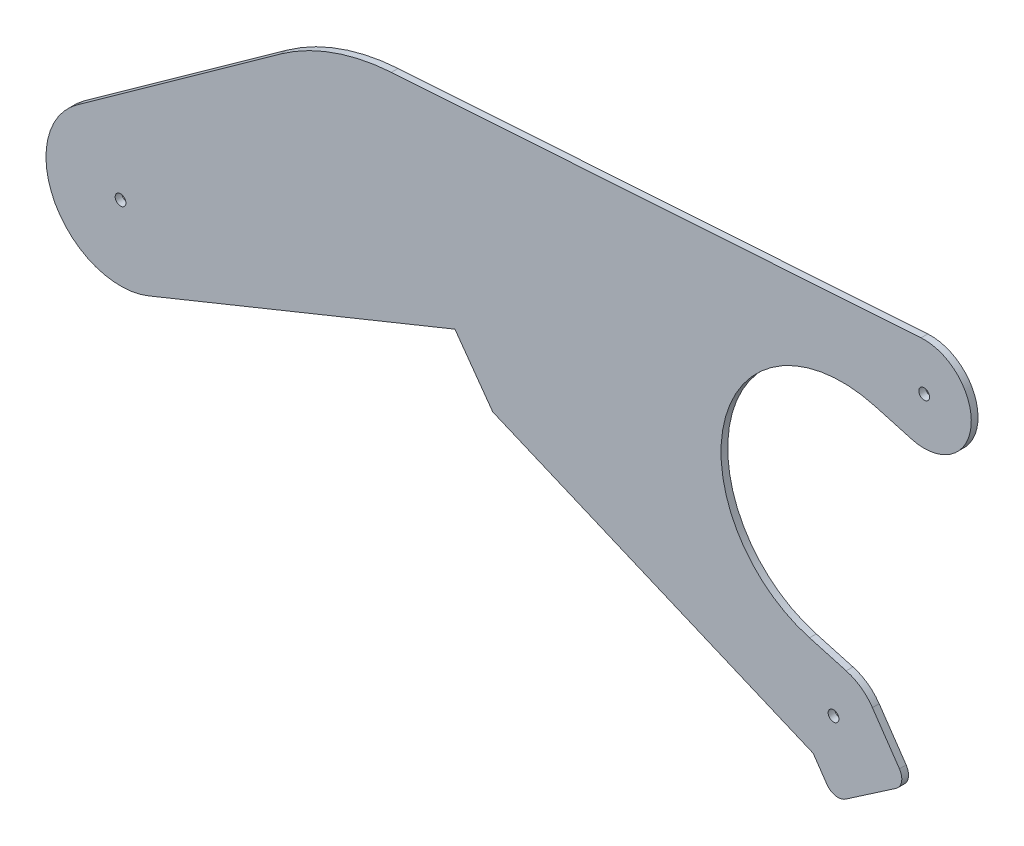
ISO-10303-21;
HEADER;
FILE_DESCRIPTION(('STEP AP214'),'2;1');
FILE_NAME('part.step','',(''),(''),'','','');
FILE_SCHEMA(('AUTOMOTIVE_DESIGN { 1 0 10303 214 1 1 1 1 }'));
ENDSEC;
DATA;
#1=APPLICATION_CONTEXT('core data for automotive mechanical design processes');
#2=APPLICATION_PROTOCOL_DEFINITION('international standard','automotive_design',2000,#1);
#3=PRODUCT_CONTEXT('',#1,'mechanical');
#4=PRODUCT('Part','Part','',(#3));
#5=PRODUCT_RELATED_PRODUCT_CATEGORY('part','',(#4));
#6=PRODUCT_DEFINITION_FORMATION('','',#4);
#7=PRODUCT_DEFINITION_CONTEXT('part definition',#1,'design');
#8=PRODUCT_DEFINITION('design','',#6,#7);
#9=PRODUCT_DEFINITION_SHAPE('','',#8);
#10=(LENGTH_UNIT() NAMED_UNIT(*) SI_UNIT(.MILLI.,.METRE.));
#11=(NAMED_UNIT(*) PLANE_ANGLE_UNIT() SI_UNIT($,.RADIAN.));
#12=(NAMED_UNIT(*) SI_UNIT($,.STERADIAN.) SOLID_ANGLE_UNIT());
#13=UNCERTAINTY_MEASURE_WITH_UNIT(LENGTH_MEASURE(1.E-05),#10,'distance_accuracy_value','');
#14=(GEOMETRIC_REPRESENTATION_CONTEXT(3) GLOBAL_UNCERTAINTY_ASSIGNED_CONTEXT((#13)) GLOBAL_UNIT_ASSIGNED_CONTEXT((#10,
#11,#12)) REPRESENTATION_CONTEXT('',''));
#15=CARTESIAN_POINT('',(0.,0.,0.));
#16=DIRECTION('',(0.,0.,1.));
#17=DIRECTION('',(1.,0.,0.));
#18=AXIS2_PLACEMENT_3D('',#15,#16,#17);
#19=CARTESIAN_POINT('',(336.287111756941,211.379197260452,3.175));
#20=DIRECTION('',(0.,0.,1.));
#21=DIRECTION('',(1.,0.,0.));
#22=AXIS2_PLACEMENT_3D('',#19,#20,#21);
#23=PLANE('',#22);
#24=CARTESIAN_POINT('',(0.,254.,3.175));
#25=DIRECTION('',(0.,0.,1.));
#26=DIRECTION('',(1.,0.,0.));
#27=AXIS2_PLACEMENT_3D('',#24,#25,#26);
#28=CIRCLE('',#27,2.54);
#29=CARTESIAN_POINT('',(2.54,254.,3.175));
#30=VERTEX_POINT('',#29);
#31=EDGE_CURVE('E415',#30,#30,#28,.T.);
#32=ORIENTED_EDGE('',*,*,#31,.F.);
#33=EDGE_LOOP('',(#32));
#34=FACE_BOUND('',#33,.T.);
#35=CARTESIAN_POINT('',(336.287111756941,211.379197260452,3.175));
#36=DIRECTION('',(0.,0.,1.));
#37=DIRECTION('',(1.,0.,0.));
#38=AXIS2_PLACEMENT_3D('',#35,#36,#37);
#39=CIRCLE('',#38,22.225);
#40=CARTESIAN_POINT('',(354.629507636946,223.929382055155,3.175));
#41=VERTEX_POINT('',#40);
#42=CARTESIAN_POINT('',(342.271098908996,232.783461386183,3.175));
#43=VERTEX_POINT('',#42);
#44=EDGE_CURVE('E253',#41,#43,#39,.T.);
#45=ORIENTED_EDGE('',*,*,#44,.T.);
#46=DIRECTION('',(-0.963071501720162,0.269245766121719,0.));
#47=VECTOR('',#46,1.);
#48=CARTESIAN_POINT('',(342.271098908996,232.783461386183,3.175));
#49=LINE('',#48,#47);
#50=CARTESIAN_POINT('',(324.973841412296,237.619253264756,3.175));
#51=VERTEX_POINT('',#50);
#52=EDGE_CURVE('E133',#43,#51,#49,.T.);
#53=ORIENTED_EDGE('',*,*,#52,.T.);
#54=CARTESIAN_POINT('',(340.361236946153,292.658789588063,3.175));
#55=DIRECTION('',(0.,0.,-1.));
#56=DIRECTION('',(-1.,0.,0.));
#57=AXIS2_PLACEMENT_3D('',#54,#55,#56);
#58=CIRCLE('',#57,57.15);
#59=CARTESIAN_POINT('',(355.748632480009,347.698325911371,3.175));
#60=VERTEX_POINT('',#59);
#61=EDGE_CURVE('E310',#51,#60,#58,.T.);
#62=ORIENTED_EDGE('',*,*,#61,.T.);
#63=DIRECTION('',(0.963071501720162,-0.269245766121719,0.));
#64=VECTOR('',#63,1.);
#65=CARTESIAN_POINT('',(355.748632480009,347.698325911371,3.175));
#66=LINE('',#65,#64);
#67=CARTESIAN_POINT('',(373.045889976708,342.862534032797,3.175));
#68=VERTEX_POINT('',#67);
#69=EDGE_CURVE('E330',#60,#68,#66,.T.);
#70=ORIENTED_EDGE('',*,*,#69,.T.);
#71=CARTESIAN_POINT('',(379.029877128764,364.266798158528,3.175));
#72=DIRECTION('',(0.,0.,1.));
#73=DIRECTION('',(1.,0.,0.));
#74=AXIS2_PLACEMENT_3D('',#71,#72,#73);
#75=CIRCLE('',#74,22.2250000000001);
#76=CARTESIAN_POINT('',(377.568221422991,386.443682240784,3.175));
#77=VERTEX_POINT('',#76);
#78=EDGE_CURVE('E326',#68,#77,#75,.T.);
#79=ORIENTED_EDGE('',*,*,#78,.T.);
#80=DIRECTION('',(-0.997835054319694,-0.0657662859740009,0.));
#81=VECTOR('',#80,1.);
#82=CARTESIAN_POINT('',(127.710075684602,369.975787878456,3.175));
#83=LINE('',#82,#81);
#84=CARTESIAN_POINT('',(127.710075684602,369.975787878456,3.175));
#85=VERTEX_POINT('',#84);
#86=EDGE_CURVE('E329',#77,#85,#83,.T.);
#87=ORIENTED_EDGE('',*,*,#86,.T.);
#88=CARTESIAN_POINT('',(134.39193033956,268.595746359575,3.175));
#89=DIRECTION('',(0.,0.,1.));
#90=DIRECTION('',(-1.,0.,0.));
#91=AXIS2_PLACEMENT_3D('',#88,#89,#90);
#92=CIRCLE('',#91,101.6);
#93=CARTESIAN_POINT('',(75.20269843353,351.174162585452,3.175));
#94=VERTEX_POINT('',#93);
#95=EDGE_CURVE('E334',#85,#94,#92,.T.);
#96=ORIENTED_EDGE('',*,*,#95,.T.);
#97=DIRECTION('',(-0.812779687262568,-0.582571180177463,0.));
#98=VECTOR('',#97,1.);
#99=CARTESIAN_POINT('',(-20.4891802815482,282.585673490457,3.175));
#100=LINE('',#99,#98);
#101=CARTESIAN_POINT('',(-20.4891802815487,282.585673490458,3.175));
#102=VERTEX_POINT('',#101);
#103=EDGE_CURVE('E341',#94,#102,#100,.T.);
#104=ORIENTED_EDGE('',*,*,#103,.T.);
#105=CARTESIAN_POINT('',(-1.83186799063151E-12,254.,3.175));
#106=DIRECTION('',(0.,0.,1.));
#107=DIRECTION('',(1.,0.,0.));
#108=AXIS2_PLACEMENT_3D('',#105,#106,#107);
#109=CIRCLE('',#108,35.1702606972537);
#110=CARTESIAN_POINT('',(13.2266281415304,221.411604127873,3.175));
#111=VERTEX_POINT('',#110);
#112=EDGE_CURVE('E344',#102,#111,#109,.T.);
#113=ORIENTED_EDGE('',*,*,#112,.T.);
#114=DIRECTION('',(0.926589545430118,0.376074213819039,0.));
#115=VECTOR('',#114,1.);
#116=CARTESIAN_POINT('',(13.2266281415304,221.411604127873,3.175));
#117=LINE('',#116,#115);
#118=CARTESIAN_POINT('',(157.720156249615,280.057085563736,3.175));
#119=VERTEX_POINT('',#118);
#120=EDGE_CURVE('E347',#111,#119,#117,.T.);
#121=ORIENTED_EDGE('',*,*,#120,.T.);
#122=DIRECTION('',(0.582571180177662,-0.812779687262425,0.));
#123=VECTOR('',#122,1.);
#124=CARTESIAN_POINT('',(157.720156249615,280.057085563736,3.175));
#125=LINE('',#124,#123);
#126=CARTESIAN_POINT('',(175.551948382823,255.178892260495,3.175));
#127=VERTEX_POINT('',#126);
#128=EDGE_CURVE('E350',#119,#127,#125,.T.);
#129=ORIENTED_EDGE('',*,*,#128,.T.);
#130=DIRECTION('',(0.921122377771039,-0.389273124129355,0.));
#131=VECTOR('',#130,1.);
#132=CARTESIAN_POINT('',(175.551948382823,255.178892260495,3.175));
#133=LINE('',#132,#131);
#134=CARTESIAN_POINT('',(326.703198738901,191.301256821272,3.175));
#135=VERTEX_POINT('',#134);
#136=EDGE_CURVE('E353',#127,#135,#133,.T.);
#137=ORIENTED_EDGE('',*,*,#136,.T.);
#138=DIRECTION('',(0.564687729795389,-0.825304651518777,0.));
#139=VECTOR('',#138,1.);
#140=CARTESIAN_POINT('',(326.703198738901,191.301256821272,3.175));
#141=LINE('',#140,#139);
#142=CARTESIAN_POINT('',(333.151451497782,181.876980862595,3.175));
#143=VERTEX_POINT('',#142);
#144=EDGE_CURVE('E356',#135,#143,#141,.T.);
#145=ORIENTED_EDGE('',*,*,#144,.T.);
#146=CARTESIAN_POINT('',(338.392136034928,185.462747946791,3.175));
#147=DIRECTION('',(0.,0.,1.));
#148=DIRECTION('',(1.,0.,0.));
#149=AXIS2_PLACEMENT_3D('',#146,#147,#148);
#150=CIRCLE('',#149,6.34999999999894);
#151=CARTESIAN_POINT('',(341.977903119125,180.222063409649,3.175));
#152=VERTEX_POINT('',#151);
#153=EDGE_CURVE('E179',#143,#152,#150,.T.);
#154=ORIENTED_EDGE('',*,*,#153,.T.);
#155=DIRECTION('',(0.825304651518776,0.564687729795391,0.));
#156=VECTOR('',#155,1.);
#157=CARTESIAN_POINT('',(341.977903119125,180.222063409649,3.175));
#158=LINE('',#157,#156);
#159=CARTESIAN_POINT('',(365.723910723195,196.469492890351,3.175));
#160=VERTEX_POINT('',#159);
#161=EDGE_CURVE('E173',#152,#160,#158,.T.);
#162=ORIENTED_EDGE('',*,*,#161,.T.);
#163=CARTESIAN_POINT('',(362.138143638995,201.710177427496,3.175));
#164=DIRECTION('',(0.,0.,1.));
#165=DIRECTION('',(1.,0.,0.));
#166=AXIS2_PLACEMENT_3D('',#163,#164,#165);
#167=CIRCLE('',#166,6.34999999999987);
#168=CARTESIAN_POINT('',(367.378828176139,205.295944511696,3.175));
#169=VERTEX_POINT('',#168);
#170=EDGE_CURVE('E177',#160,#169,#167,.T.);
#171=ORIENTED_EDGE('',*,*,#170,.T.);
#172=DIRECTION('',(-0.564687729795388,0.825304651518778,0.));
#173=VECTOR('',#172,1.);
#174=CARTESIAN_POINT('',(367.378828176139,205.295944511696,3.175));
#175=LINE('',#174,#173);
#176=EDGE_CURVE('E63',#169,#41,#175,.T.);
#177=ORIENTED_EDGE('',*,*,#176,.T.);
#178=EDGE_LOOP('',(#45,#53,#62,#70,#79,#87,#96,#104,#113,#121,#129,#137,#145,#154,#162,#171,#177));
#179=FACE_BOUND('',#178,.T.);
#180=CARTESIAN_POINT('',(336.287111756941,211.379197260452,3.175));
#181=DIRECTION('',(0.,0.,1.));
#182=DIRECTION('',(1.,0.,0.));
#183=AXIS2_PLACEMENT_3D('',#180,#181,#182);
#184=CIRCLE('',#183,2.54000000000001);
#185=CARTESIAN_POINT('',(338.827111756941,211.379197260452,3.175));
#186=VERTEX_POINT('',#185);
#187=EDGE_CURVE('E206',#186,#186,#184,.T.);
#188=ORIENTED_EDGE('',*,*,#187,.F.);
#189=EDGE_LOOP('',(#188));
#190=FACE_BOUND('',#189,.T.);
#191=CARTESIAN_POINT('',(379.029877128764,364.266798158528,3.175));
#192=DIRECTION('',(0.,0.,1.));
#193=DIRECTION('',(1.,0.,0.));
#194=AXIS2_PLACEMENT_3D('',#191,#192,#193);
#195=CIRCLE('',#194,2.54000000000024);
#196=CARTESIAN_POINT('',(381.569877128764,364.266798158528,3.175));
#197=VERTEX_POINT('',#196);
#198=EDGE_CURVE('E404',#197,#197,#195,.T.);
#199=ORIENTED_EDGE('',*,*,#198,.F.);
#200=EDGE_LOOP('',(#199));
#201=FACE_BOUND('',#200,.T.);
#202=ADVANCED_FACE('F45',(#34,#179,#190,#201),#23,.T.);
#203=CARTESIAN_POINT('',(336.287111756941,211.379197260452,0.));
#204=DIRECTION('',(0.,0.,1.));
#205=DIRECTION('',(1.,0.,0.));
#206=AXIS2_PLACEMENT_3D('',#203,#204,#205);
#207=PLANE('',#206);
#208=CARTESIAN_POINT('',(336.287111756941,211.379197260452,0.));
#209=DIRECTION('',(0.,0.,1.));
#210=DIRECTION('',(1.,0.,0.));
#211=AXIS2_PLACEMENT_3D('',#208,#209,#210);
#212=CIRCLE('',#211,22.225);
#213=CARTESIAN_POINT('',(354.629507636946,223.929382055155,0.));
#214=VERTEX_POINT('',#213);
#215=CARTESIAN_POINT('',(342.271098908996,232.783461386183,0.));
#216=VERTEX_POINT('',#215);
#217=EDGE_CURVE('E201',#214,#216,#212,.T.);
#218=ORIENTED_EDGE('',*,*,#217,.F.);
#219=DIRECTION('',(-0.564687729795388,0.825304651518778,0.));
#220=VECTOR('',#219,1.);
#221=CARTESIAN_POINT('',(367.378828176139,205.295944511696,0.));
#222=LINE('',#221,#220);
#223=CARTESIAN_POINT('',(367.378828176139,205.295944511696,0.));
#224=VERTEX_POINT('',#223);
#225=EDGE_CURVE('E125',#224,#214,#222,.T.);
#226=ORIENTED_EDGE('',*,*,#225,.F.);
#227=CARTESIAN_POINT('',(362.138143638995,201.710177427496,0.));
#228=DIRECTION('',(0.,0.,1.));
#229=DIRECTION('',(1.,0.,0.));
#230=AXIS2_PLACEMENT_3D('',#227,#228,#229);
#231=CIRCLE('',#230,6.34999999999987);
#232=CARTESIAN_POINT('',(365.723910723195,196.469492890351,0.));
#233=VERTEX_POINT('',#232);
#234=EDGE_CURVE('E119',#233,#224,#231,.T.);
#235=ORIENTED_EDGE('',*,*,#234,.F.);
#236=DIRECTION('',(0.825304651518776,0.564687729795391,0.));
#237=VECTOR('',#236,1.);
#238=CARTESIAN_POINT('',(341.977903119125,180.222063409649,0.));
#239=LINE('',#238,#237);
#240=CARTESIAN_POINT('',(341.977903119125,180.222063409649,0.));
#241=VERTEX_POINT('',#240);
#242=EDGE_CURVE('E188',#241,#233,#239,.T.);
#243=ORIENTED_EDGE('',*,*,#242,.F.);
#244=CARTESIAN_POINT('',(338.392136034928,185.462747946791,0.));
#245=DIRECTION('',(0.,0.,1.));
#246=DIRECTION('',(1.,0.,0.));
#247=AXIS2_PLACEMENT_3D('',#244,#245,#246);
#248=CIRCLE('',#247,6.34999999999894);
#249=CARTESIAN_POINT('',(333.151451497782,181.876980862595,0.));
#250=VERTEX_POINT('',#249);
#251=EDGE_CURVE('E244',#250,#241,#248,.T.);
#252=ORIENTED_EDGE('',*,*,#251,.F.);
#253=DIRECTION('',(0.564687729795389,-0.825304651518777,0.));
#254=VECTOR('',#253,1.);
#255=CARTESIAN_POINT('',(326.703198738901,191.301256821272,0.));
#256=LINE('',#255,#254);
#257=CARTESIAN_POINT('',(326.703198738901,191.301256821272,0.));
#258=VERTEX_POINT('',#257);
#259=EDGE_CURVE('E241',#258,#250,#256,.T.);
#260=ORIENTED_EDGE('',*,*,#259,.F.);
#261=DIRECTION('',(0.921122377771039,-0.389273124129354,0.));
#262=VECTOR('',#261,1.);
#263=CARTESIAN_POINT('',(311.091686830702,197.898797125952,0.));
#264=LINE('',#263,#262);
#265=CARTESIAN_POINT('',(175.551948382823,255.178892260495,0.));
#266=VERTEX_POINT('',#265);
#267=EDGE_CURVE('E238',#266,#258,#264,.T.);
#268=ORIENTED_EDGE('',*,*,#267,.F.);
#269=DIRECTION('',(0.582571180177662,-0.812779687262425,0.));
#270=VECTOR('',#269,1.);
#271=CARTESIAN_POINT('',(157.720156249615,280.057085563736,0.));
#272=LINE('',#271,#270);
#273=CARTESIAN_POINT('',(157.720156249615,280.057085563736,0.));
#274=VERTEX_POINT('',#273);
#275=EDGE_CURVE('E234',#274,#266,#272,.T.);
#276=ORIENTED_EDGE('',*,*,#275,.F.);
#277=DIRECTION('',(0.926589545430117,0.376074213819039,0.));
#278=VECTOR('',#277,1.);
#279=CARTESIAN_POINT('',(97.7926588472695,255.734356494666,0.));
#280=LINE('',#279,#278);
#281=CARTESIAN_POINT('',(13.2266281415304,221.411604127873,0.));
#282=VERTEX_POINT('',#281);
#283=EDGE_CURVE('E231',#282,#274,#280,.T.);
#284=ORIENTED_EDGE('',*,*,#283,.F.);
#285=CARTESIAN_POINT('',(-1.83186799063151E-12,254.,0.));
#286=DIRECTION('',(0.,0.,1.));
#287=DIRECTION('',(1.,0.,0.));
#288=AXIS2_PLACEMENT_3D('',#285,#286,#287);
#289=CIRCLE('',#288,35.1702606972537);
#290=CARTESIAN_POINT('',(-20.4891802815487,282.585673490458,0.));
#291=VERTEX_POINT('',#290);
#292=EDGE_CURVE('E227',#291,#282,#289,.T.);
#293=ORIENTED_EDGE('',*,*,#292,.F.);
#294=DIRECTION('',(-0.812779687262568,-0.582571180177463,0.));
#295=VECTOR('',#294,1.);
#296=CARTESIAN_POINT('',(-20.4891802815482,282.585673490457,0.));
#297=LINE('',#296,#295);
#298=CARTESIAN_POINT('',(75.20269843353,351.174162585452,0.));
#299=VERTEX_POINT('',#298);
#300=EDGE_CURVE('E224',#299,#291,#297,.T.);
#301=ORIENTED_EDGE('',*,*,#300,.F.);
#302=CARTESIAN_POINT('',(134.39193033956,268.595746359575,0.));
#303=DIRECTION('',(0.,0.,1.));
#304=DIRECTION('',(-1.,0.,0.));
#305=AXIS2_PLACEMENT_3D('',#302,#303,#304);
#306=CIRCLE('',#305,101.6);
#307=CARTESIAN_POINT('',(127.710075684602,369.975787878456,0.));
#308=VERTEX_POINT('',#307);
#309=EDGE_CURVE('E221',#308,#299,#306,.T.);
#310=ORIENTED_EDGE('',*,*,#309,.F.);
#311=DIRECTION('',(-0.997835054319694,-0.0657662859740009,0.));
#312=VECTOR('',#311,1.);
#313=CARTESIAN_POINT('',(127.710075684602,369.975787878456,0.));
#314=LINE('',#313,#312);
#315=CARTESIAN_POINT('',(377.568221422991,386.443682240784,0.));
#316=VERTEX_POINT('',#315);
#317=EDGE_CURVE('E218',#316,#308,#314,.T.);
#318=ORIENTED_EDGE('',*,*,#317,.F.);
#319=CARTESIAN_POINT('',(379.029877128764,364.266798158528,0.));
#320=DIRECTION('',(0.,0.,1.));
#321=DIRECTION('',(1.,0.,0.));
#322=AXIS2_PLACEMENT_3D('',#319,#320,#321);
#323=CIRCLE('',#322,22.2250000000001);
#324=CARTESIAN_POINT('',(373.045889976708,342.862534032797,0.));
#325=VERTEX_POINT('',#324);
#326=EDGE_CURVE('E215',#325,#316,#323,.T.);
#327=ORIENTED_EDGE('',*,*,#326,.F.);
#328=DIRECTION('',(0.963071501720162,-0.269245766121719,0.));
#329=VECTOR('',#328,1.);
#330=CARTESIAN_POINT('',(355.748632480009,347.698325911371,0.));
#331=LINE('',#330,#329);
#332=CARTESIAN_POINT('',(355.748632480009,347.698325911371,0.));
#333=VERTEX_POINT('',#332);
#334=EDGE_CURVE('E212',#333,#325,#331,.T.);
#335=ORIENTED_EDGE('',*,*,#334,.F.);
#336=CARTESIAN_POINT('',(340.361236946153,292.658789588063,0.));
#337=DIRECTION('',(0.,0.,-1.));
#338=DIRECTION('',(-1.,0.,0.));
#339=AXIS2_PLACEMENT_3D('',#336,#337,#338);
#340=CIRCLE('',#339,57.15);
#341=CARTESIAN_POINT('',(324.973841412296,237.619253264756,0.));
#342=VERTEX_POINT('',#341);
#343=EDGE_CURVE('E209',#342,#333,#340,.T.);
#344=ORIENTED_EDGE('',*,*,#343,.F.);
#345=DIRECTION('',(-0.963071501720162,0.269245766121719,0.));
#346=VECTOR('',#345,1.);
#347=CARTESIAN_POINT('',(342.271098908996,232.783461386183,0.));
#348=LINE('',#347,#346);
#349=EDGE_CURVE('E205',#216,#342,#348,.T.);
#350=ORIENTED_EDGE('',*,*,#349,.F.);
#351=EDGE_LOOP('',(#218,#226,#235,#243,#252,#260,#268,#276,#284,#293,#301,#310,#318,#327,#335,
#344,#350));
#352=FACE_BOUND('',#351,.T.);
#353=CARTESIAN_POINT('',(336.287111756941,211.379197260452,0.));
#354=DIRECTION('',(0.,0.,1.));
#355=DIRECTION('',(1.,0.,0.));
#356=AXIS2_PLACEMENT_3D('',#353,#354,#355);
#357=CIRCLE('',#356,2.54000000000001);
#358=CARTESIAN_POINT('',(338.827111756941,211.379197260452,0.));
#359=VERTEX_POINT('',#358);
#360=EDGE_CURVE('E419',#359,#359,#357,.T.);
#361=ORIENTED_EDGE('',*,*,#360,.T.);
#362=EDGE_LOOP('',(#361));
#363=FACE_BOUND('',#362,.T.);
#364=CARTESIAN_POINT('',(0.,254.,0.));
#365=DIRECTION('',(0.,0.,1.));
#366=DIRECTION('',(1.,0.,0.));
#367=AXIS2_PLACEMENT_3D('',#364,#365,#366);
#368=CIRCLE('',#367,2.54);
#369=CARTESIAN_POINT('',(2.54,254.,0.));
#370=VERTEX_POINT('',#369);
#371=EDGE_CURVE('E412',#370,#370,#368,.T.);
#372=ORIENTED_EDGE('',*,*,#371,.T.);
#373=EDGE_LOOP('',(#372));
#374=FACE_BOUND('',#373,.T.);
#375=CARTESIAN_POINT('',(379.029877128764,364.266798158528,0.));
#376=DIRECTION('',(0.,0.,1.));
#377=DIRECTION('',(1.,0.,0.));
#378=AXIS2_PLACEMENT_3D('',#375,#376,#377);
#379=CIRCLE('',#378,2.54000000000024);
#380=CARTESIAN_POINT('',(381.569877128764,364.266798158528,0.));
#381=VERTEX_POINT('',#380);
#382=EDGE_CURVE('E407',#381,#381,#379,.T.);
#383=ORIENTED_EDGE('',*,*,#382,.T.);
#384=EDGE_LOOP('',(#383));
#385=FACE_BOUND('',#384,.T.);
#386=ADVANCED_FACE('F314',(#352,#363,#374,#385),#207,.F.);
#387=CARTESIAN_POINT('',(336.287111756941,211.379197260452,3.175));
#388=DIRECTION('',(0.,0.,-1.));
#389=DIRECTION('',(-1.,0.,0.));
#390=AXIS2_PLACEMENT_3D('',#387,#388,#389);
#391=CYLINDRICAL_SURFACE('',#390,22.225);
#392=ORIENTED_EDGE('',*,*,#217,.T.);
#393=DIRECTION('',(0.,0.,-1.));
#394=VECTOR('',#393,1.);
#395=CARTESIAN_POINT('',(342.271098908996,232.783461386183,3.175));
#396=LINE('',#395,#394);
#397=EDGE_CURVE('E11',#43,#216,#396,.T.);
#398=ORIENTED_EDGE('',*,*,#397,.F.);
#399=ORIENTED_EDGE('',*,*,#44,.F.);
#400=DIRECTION('',(0.,0.,-1.));
#401=VECTOR('',#400,1.);
#402=CARTESIAN_POINT('',(354.629507636946,223.929382055155,3.175));
#403=LINE('',#402,#401);
#404=EDGE_CURVE('E197',#41,#214,#403,.T.);
#405=ORIENTED_EDGE('',*,*,#404,.T.);
#406=EDGE_LOOP('',(#392,#398,#399,#405));
#407=FACE_BOUND('',#406,.T.);
#408=ADVANCED_FACE('F47',(#407),#391,.T.);
#409=CARTESIAN_POINT('',(342.271098908996,232.783461386183,3.175));
#410=DIRECTION('',(-0.269245766121719,-0.963071501720162,0.));
#411=DIRECTION('',(0.963071501720162,-0.269245766121719,0.));
#412=AXIS2_PLACEMENT_3D('',#409,#410,#411);
#413=PLANE('',#412);
#414=ORIENTED_EDGE('',*,*,#349,.T.);
#415=DIRECTION('',(0.,0.,-1.));
#416=VECTOR('',#415,1.);
#417=CARTESIAN_POINT('',(324.973841412296,237.619253264756,3.175));
#418=LINE('',#417,#416);
#419=EDGE_CURVE('E55',#51,#342,#418,.T.);
#420=ORIENTED_EDGE('',*,*,#419,.F.);
#421=ORIENTED_EDGE('',*,*,#52,.F.);
#422=ORIENTED_EDGE('',*,*,#397,.T.);
#423=EDGE_LOOP('',(#414,#420,#421,#422));
#424=FACE_BOUND('',#423,.T.);
#425=ADVANCED_FACE('F572',(#424),#413,.F.);
#426=CARTESIAN_POINT('',(340.361236946153,292.658789588063,3.175));
#427=DIRECTION('',(0.,0.,-1.));
#428=DIRECTION('',(-1.,0.,0.));
#429=AXIS2_PLACEMENT_3D('',#426,#427,#428);
#430=CYLINDRICAL_SURFACE('',#429,57.15);
#431=ORIENTED_EDGE('',*,*,#343,.T.);
#432=DIRECTION('',(0.,0.,-1.));
#433=VECTOR('',#432,1.);
#434=CARTESIAN_POINT('',(355.748632480009,347.698325911371,3.175));
#435=LINE('',#434,#433);
#436=EDGE_CURVE('E300',#60,#333,#435,.T.);
#437=ORIENTED_EDGE('',*,*,#436,.F.);
#438=ORIENTED_EDGE('',*,*,#61,.F.);
#439=ORIENTED_EDGE('',*,*,#419,.T.);
#440=EDGE_LOOP('',(#431,#437,#438,#439));
#441=FACE_BOUND('',#440,.T.);
#442=ADVANCED_FACE('F308',(#441),#430,.F.);
#443=CARTESIAN_POINT('',(355.748632480009,347.698325911371,3.175));
#444=DIRECTION('',(0.269245766121719,0.963071501720162,0.));
#445=DIRECTION('',(-0.963071501720162,0.269245766121719,0.));
#446=AXIS2_PLACEMENT_3D('',#443,#444,#445);
#447=PLANE('',#446);
#448=ORIENTED_EDGE('',*,*,#334,.T.);
#449=DIRECTION('',(0.,0.,-1.));
#450=VECTOR('',#449,1.);
#451=CARTESIAN_POINT('',(373.045889976708,342.862534032797,3.175));
#452=LINE('',#451,#450);
#453=EDGE_CURVE('E296',#68,#325,#452,.T.);
#454=ORIENTED_EDGE('',*,*,#453,.F.);
#455=ORIENTED_EDGE('',*,*,#69,.F.);
#456=ORIENTED_EDGE('',*,*,#436,.T.);
#457=EDGE_LOOP('',(#448,#454,#455,#456));
#458=FACE_BOUND('',#457,.T.);
#459=ADVANCED_FACE('F320',(#458),#447,.F.);
#460=CARTESIAN_POINT('',(379.029877128764,364.266798158528,3.175));
#461=DIRECTION('',(0.,0.,-1.));
#462=DIRECTION('',(-1.,0.,0.));
#463=AXIS2_PLACEMENT_3D('',#460,#461,#462);
#464=CYLINDRICAL_SURFACE('',#463,22.2250000000001);
#465=ORIENTED_EDGE('',*,*,#326,.T.);
#466=DIRECTION('',(0.,0.,-1.));
#467=VECTOR('',#466,1.);
#468=CARTESIAN_POINT('',(377.568221422991,386.443682240784,3.175));
#469=LINE('',#468,#467);
#470=EDGE_CURVE('E292',#77,#316,#469,.T.);
#471=ORIENTED_EDGE('',*,*,#470,.F.);
#472=ORIENTED_EDGE('',*,*,#78,.F.);
#473=ORIENTED_EDGE('',*,*,#453,.T.);
#474=EDGE_LOOP('',(#465,#471,#472,#473));
#475=FACE_BOUND('',#474,.T.);
#476=ADVANCED_FACE('F324',(#475),#464,.T.);
#477=CARTESIAN_POINT('',(127.710075684602,369.975787878456,3.175));
#478=DIRECTION('',(0.0657662859740009,-0.997835054319694,0.));
#479=DIRECTION('',(0.997835054319694,0.0657662859740009,0.));
#480=AXIS2_PLACEMENT_3D('',#477,#478,#479);
#481=PLANE('',#480);
#482=ORIENTED_EDGE('',*,*,#317,.T.);
#483=DIRECTION('',(0.,0.,-1.));
#484=VECTOR('',#483,1.);
#485=CARTESIAN_POINT('',(127.710075684602,369.975787878456,3.175));
#486=LINE('',#485,#484);
#487=EDGE_CURVE('E288',#85,#308,#486,.T.);
#488=ORIENTED_EDGE('',*,*,#487,.F.);
#489=ORIENTED_EDGE('',*,*,#86,.F.);
#490=ORIENTED_EDGE('',*,*,#470,.T.);
#491=EDGE_LOOP('',(#482,#488,#489,#490));
#492=FACE_BOUND('',#491,.T.);
#493=ADVANCED_FACE('F541',(#492),#481,.F.);
#494=CARTESIAN_POINT('',(134.39193033956,268.595746359575,3.175));
#495=DIRECTION('',(0.,0.,-1.));
#496=DIRECTION('',(-1.,0.,0.));
#497=AXIS2_PLACEMENT_3D('',#494,#495,#496);
#498=CYLINDRICAL_SURFACE('',#497,101.6);
#499=ORIENTED_EDGE('',*,*,#309,.T.);
#500=DIRECTION('',(0.,0.,-1.));
#501=VECTOR('',#500,1.);
#502=CARTESIAN_POINT('',(75.20269843353,351.174162585452,3.175));
#503=LINE('',#502,#501);
#504=EDGE_CURVE('E284',#94,#299,#503,.T.);
#505=ORIENTED_EDGE('',*,*,#504,.F.);
#506=ORIENTED_EDGE('',*,*,#95,.F.);
#507=ORIENTED_EDGE('',*,*,#487,.T.);
#508=EDGE_LOOP('',(#499,#505,#506,#507));
#509=FACE_BOUND('',#508,.T.);
#510=ADVANCED_FACE('F532',(#509),#498,.T.);
#511=CARTESIAN_POINT('',(-20.4891802815482,282.585673490457,3.175));
#512=DIRECTION('',(0.582571180177463,-0.812779687262568,0.));
#513=DIRECTION('',(0.812779687262568,0.582571180177463,0.));
#514=AXIS2_PLACEMENT_3D('',#511,#512,#513);
#515=PLANE('',#514);
#516=ORIENTED_EDGE('',*,*,#300,.T.);
#517=DIRECTION('',(0.,0.,-1.));
#518=VECTOR('',#517,1.);
#519=CARTESIAN_POINT('',(-20.4891802815487,282.585673490458,3.175));
#520=LINE('',#519,#518);
#521=EDGE_CURVE('E280',#102,#291,#520,.T.);
#522=ORIENTED_EDGE('',*,*,#521,.F.);
#523=ORIENTED_EDGE('',*,*,#103,.F.);
#524=ORIENTED_EDGE('',*,*,#504,.T.);
#525=EDGE_LOOP('',(#516,#522,#523,#524));
#526=FACE_BOUND('',#525,.T.);
#527=ADVANCED_FACE('F523',(#526),#515,.F.);
#528=CARTESIAN_POINT('',(-1.83186799063151E-12,254.,3.175));
#529=DIRECTION('',(0.,0.,-1.));
#530=DIRECTION('',(-1.,0.,0.));
#531=AXIS2_PLACEMENT_3D('',#528,#529,#530);
#532=CYLINDRICAL_SURFACE('',#531,35.1702606972537);
#533=ORIENTED_EDGE('',*,*,#292,.T.);
#534=DIRECTION('',(0.,0.,-1.));
#535=VECTOR('',#534,1.);
#536=CARTESIAN_POINT('',(13.2266281415304,221.411604127873,3.175));
#537=LINE('',#536,#535);
#538=EDGE_CURVE('E276',#111,#282,#537,.T.);
#539=ORIENTED_EDGE('',*,*,#538,.F.);
#540=ORIENTED_EDGE('',*,*,#112,.F.);
#541=ORIENTED_EDGE('',*,*,#521,.T.);
#542=EDGE_LOOP('',(#533,#539,#540,#541));
#543=FACE_BOUND('',#542,.T.);
#544=ADVANCED_FACE('F514',(#543),#532,.T.);
#545=CARTESIAN_POINT('',(97.7926588472695,255.734356494666,3.175));
#546=DIRECTION('',(-0.376074213819039,0.926589545430117,0.));
#547=DIRECTION('',(-0.926589545430117,-0.376074213819039,0.));
#548=AXIS2_PLACEMENT_3D('',#545,#546,#547);
#549=PLANE('',#548);
#550=ORIENTED_EDGE('',*,*,#283,.T.);
#551=DIRECTION('',(0.,0.,-1.));
#552=VECTOR('',#551,1.);
#553=CARTESIAN_POINT('',(157.720156249615,280.057085563736,3.175));
#554=LINE('',#553,#552);
#555=EDGE_CURVE('E272',#119,#274,#554,.T.);
#556=ORIENTED_EDGE('',*,*,#555,.F.);
#557=ORIENTED_EDGE('',*,*,#120,.F.);
#558=ORIENTED_EDGE('',*,*,#538,.T.);
#559=EDGE_LOOP('',(#550,#556,#557,#558));
#560=FACE_BOUND('',#559,.T.);
#561=ADVANCED_FACE('F505',(#560),#549,.F.);
#562=CARTESIAN_POINT('',(157.720156249615,280.057085563736,3.175));
#563=DIRECTION('',(0.812779687262425,0.582571180177662,0.));
#564=DIRECTION('',(-0.582571180177662,0.812779687262426,0.));
#565=AXIS2_PLACEMENT_3D('',#562,#563,#564);
#566=PLANE('',#565);
#567=ORIENTED_EDGE('',*,*,#275,.T.);
#568=DIRECTION('',(0.,0.,-1.));
#569=VECTOR('',#568,1.);
#570=CARTESIAN_POINT('',(175.551948382823,255.178892260495,3.175));
#571=LINE('',#570,#569);
#572=EDGE_CURVE('E268',#127,#266,#571,.T.);
#573=ORIENTED_EDGE('',*,*,#572,.F.);
#574=ORIENTED_EDGE('',*,*,#128,.F.);
#575=ORIENTED_EDGE('',*,*,#555,.T.);
#576=EDGE_LOOP('',(#567,#573,#574,#575));
#577=FACE_BOUND('',#576,.T.);
#578=ADVANCED_FACE('F495',(#577),#566,.F.);
#579=CARTESIAN_POINT('',(311.091686830702,197.898797125952,3.175));
#580=DIRECTION('',(0.389273124129354,0.921122377771039,0.));
#581=DIRECTION('',(-0.921122377771039,0.389273124129354,0.));
#582=AXIS2_PLACEMENT_3D('',#579,#580,#581);
#583=PLANE('',#582);
#584=ORIENTED_EDGE('',*,*,#267,.T.);
#585=DIRECTION('',(0.,0.,-1.));
#586=VECTOR('',#585,1.);
#587=CARTESIAN_POINT('',(326.703198738901,191.301256821272,3.175));
#588=LINE('',#587,#586);
#589=EDGE_CURVE('E264',#135,#258,#588,.T.);
#590=ORIENTED_EDGE('',*,*,#589,.F.);
#591=ORIENTED_EDGE('',*,*,#136,.F.);
#592=ORIENTED_EDGE('',*,*,#572,.T.);
#593=EDGE_LOOP('',(#584,#590,#591,#592));
#594=FACE_BOUND('',#593,.T.);
#595=ADVANCED_FACE('F486',(#594),#583,.F.);
#596=CARTESIAN_POINT('',(326.703198738901,191.301256821272,3.175));
#597=DIRECTION('',(0.825304651518777,0.564687729795389,0.));
#598=DIRECTION('',(-0.564687729795389,0.825304651518777,0.));
#599=AXIS2_PLACEMENT_3D('',#596,#597,#598);
#600=PLANE('',#599);
#601=ORIENTED_EDGE('',*,*,#259,.T.);
#602=DIRECTION('',(0.,0.,-1.));
#603=VECTOR('',#602,1.);
#604=CARTESIAN_POINT('',(333.151451497782,181.876980862595,3.175));
#605=LINE('',#604,#603);
#606=EDGE_CURVE('E260',#143,#250,#605,.T.);
#607=ORIENTED_EDGE('',*,*,#606,.F.);
#608=ORIENTED_EDGE('',*,*,#144,.F.);
#609=ORIENTED_EDGE('',*,*,#589,.T.);
#610=EDGE_LOOP('',(#601,#607,#608,#609));
#611=FACE_BOUND('',#610,.T.);
#612=ADVANCED_FACE('F364',(#611),#600,.F.);
#613=CARTESIAN_POINT('',(338.392136034928,185.462747946791,3.175));
#614=DIRECTION('',(0.,0.,-1.));
#615=DIRECTION('',(-1.,0.,0.));
#616=AXIS2_PLACEMENT_3D('',#613,#614,#615);
#617=CYLINDRICAL_SURFACE('',#616,6.34999999999894);
#618=ORIENTED_EDGE('',*,*,#251,.T.);
#619=DIRECTION('',(0.,0.,-1.));
#620=VECTOR('',#619,1.);
#621=CARTESIAN_POINT('',(341.977903119125,180.222063409649,3.175));
#622=LINE('',#621,#620);
#623=EDGE_CURVE('E190',#152,#241,#622,.T.);
#624=ORIENTED_EDGE('',*,*,#623,.F.);
#625=ORIENTED_EDGE('',*,*,#153,.F.);
#626=ORIENTED_EDGE('',*,*,#606,.T.);
#627=EDGE_LOOP('',(#618,#624,#625,#626));
#628=FACE_BOUND('',#627,.T.);
#629=ADVANCED_FACE('F368',(#628),#617,.T.);
#630=CARTESIAN_POINT('',(341.977903119125,180.222063409649,3.175));
#631=DIRECTION('',(-0.564687729795391,0.825304651518776,0.));
#632=DIRECTION('',(-0.825304651518776,-0.564687729795391,0.));
#633=AXIS2_PLACEMENT_3D('',#630,#631,#632);
#634=PLANE('',#633);
#635=ORIENTED_EDGE('',*,*,#242,.T.);
#636=DIRECTION('',(0.,0.,-1.));
#637=VECTOR('',#636,1.);
#638=CARTESIAN_POINT('',(365.723910723195,196.469492890351,3.175));
#639=LINE('',#638,#637);
#640=EDGE_CURVE('E185',#160,#233,#639,.T.);
#641=ORIENTED_EDGE('',*,*,#640,.F.);
#642=ORIENTED_EDGE('',*,*,#161,.F.);
#643=ORIENTED_EDGE('',*,*,#623,.T.);
#644=EDGE_LOOP('',(#635,#641,#642,#643));
#645=FACE_BOUND('',#644,.T.);
#646=ADVANCED_FACE('F186',(#645),#634,.F.);
#647=CARTESIAN_POINT('',(362.138143638995,201.710177427496,3.175));
#648=DIRECTION('',(0.,0.,-1.));
#649=DIRECTION('',(-1.,0.,0.));
#650=AXIS2_PLACEMENT_3D('',#647,#648,#649);
#651=CYLINDRICAL_SURFACE('',#650,6.34999999999987);
#652=ORIENTED_EDGE('',*,*,#234,.T.);
#653=DIRECTION('',(0.,0.,-1.));
#654=VECTOR('',#653,1.);
#655=CARTESIAN_POINT('',(367.378828176139,205.295944511696,3.175));
#656=LINE('',#655,#654);
#657=EDGE_CURVE('E191',#169,#224,#656,.T.);
#658=ORIENTED_EDGE('',*,*,#657,.F.);
#659=ORIENTED_EDGE('',*,*,#170,.F.);
#660=ORIENTED_EDGE('',*,*,#640,.T.);
#661=EDGE_LOOP('',(#652,#658,#659,#660));
#662=FACE_BOUND('',#661,.T.);
#663=ADVANCED_FACE('F193',(#662),#651,.T.);
#664=CARTESIAN_POINT('',(367.378828176139,205.295944511696,3.175));
#665=DIRECTION('',(-0.825304651518778,-0.564687729795388,0.));
#666=DIRECTION('',(0.564687729795388,-0.825304651518778,0.));
#667=AXIS2_PLACEMENT_3D('',#664,#665,#666);
#668=PLANE('',#667);
#669=ORIENTED_EDGE('',*,*,#225,.T.);
#670=ORIENTED_EDGE('',*,*,#404,.F.);
#671=ORIENTED_EDGE('',*,*,#176,.F.);
#672=ORIENTED_EDGE('',*,*,#657,.T.);
#673=EDGE_LOOP('',(#669,#670,#671,#672));
#674=FACE_BOUND('',#673,.T.);
#675=ADVANCED_FACE('F372',(#674),#668,.F.);
#676=CARTESIAN_POINT('',(336.287111756941,211.379197260452,3.175));
#677=DIRECTION('',(0.,0.,-1.));
#678=DIRECTION('',(-1.,0.,0.));
#679=AXIS2_PLACEMENT_3D('',#676,#677,#678);
#680=CYLINDRICAL_SURFACE('',#679,2.54000000000001);
#681=ORIENTED_EDGE('',*,*,#187,.T.);
#682=EDGE_LOOP('',(#681));
#683=FACE_BOUND('',#682,.T.);
#684=ORIENTED_EDGE('',*,*,#360,.F.);
#685=EDGE_LOOP('',(#684));
#686=FACE_BOUND('',#685,.T.);
#687=ADVANCED_FACE('F374',(#683,#686),#680,.F.);
#688=CARTESIAN_POINT('',(0.,254.,3.175));
#689=DIRECTION('',(0.,0.,-1.));
#690=DIRECTION('',(-1.,0.,0.));
#691=AXIS2_PLACEMENT_3D('',#688,#689,#690);
#692=CYLINDRICAL_SURFACE('',#691,2.54);
#693=ORIENTED_EDGE('',*,*,#31,.T.);
#694=EDGE_LOOP('',(#693));
#695=FACE_BOUND('',#694,.T.);
#696=ORIENTED_EDGE('',*,*,#371,.F.);
#697=EDGE_LOOP('',(#696));
#698=FACE_BOUND('',#697,.T.);
#699=ADVANCED_FACE('F380',(#695,#698),#692,.F.);
#700=CARTESIAN_POINT('',(379.029877128764,364.266798158528,3.175));
#701=DIRECTION('',(0.,0.,-1.));
#702=DIRECTION('',(-1.,0.,0.));
#703=AXIS2_PLACEMENT_3D('',#700,#701,#702);
#704=CYLINDRICAL_SURFACE('',#703,2.54000000000024);
#705=ORIENTED_EDGE('',*,*,#198,.T.);
#706=EDGE_LOOP('',(#705));
#707=FACE_BOUND('',#706,.T.);
#708=ORIENTED_EDGE('',*,*,#382,.F.);
#709=EDGE_LOOP('',(#708));
#710=FACE_BOUND('',#709,.T.);
#711=ADVANCED_FACE('F395',(#707,#710),#704,.F.);
#712=CLOSED_SHELL('',(#202,#386,#408,#425,#442,#459,#476,#493,#510,#527,#544,#561,#578,#595,
#612,#629,#646,#663,#675,#687,#699,#711));
#713=MANIFOLD_SOLID_BREP('B2',#712);
#714=ADVANCED_BREP_SHAPE_REPRESENTATION('',(#18,#713),#14);
#715=SHAPE_DEFINITION_REPRESENTATION(#9,#714);
ENDSEC;
END-ISO-10303-21;
